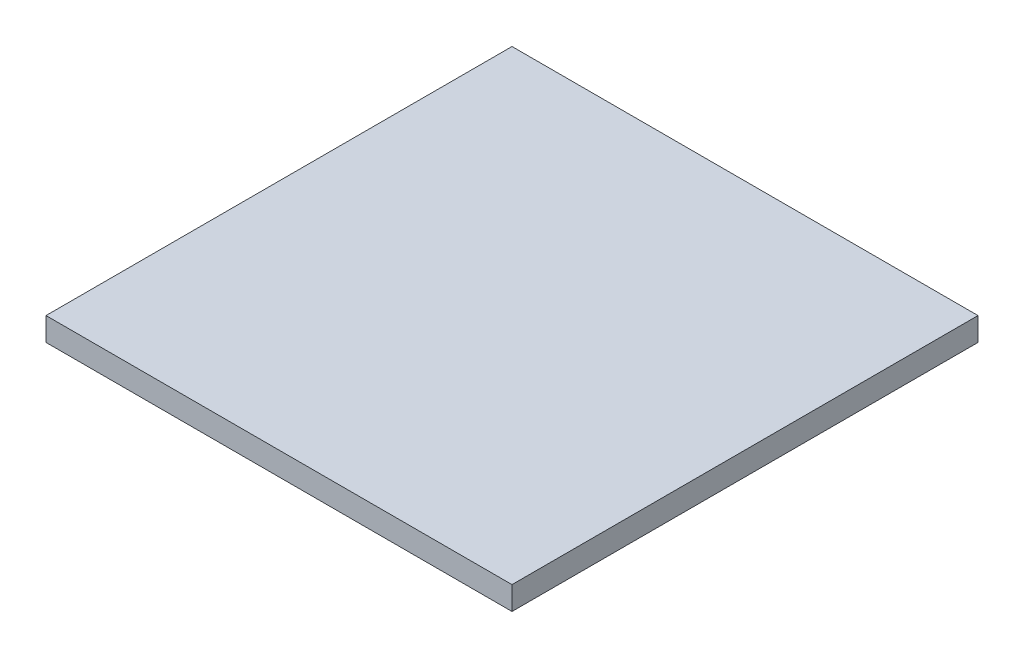
ISO-10303-21;
HEADER;
FILE_DESCRIPTION(('STEP AP214'),'2;1');
FILE_NAME('part.step','',(''),(''),'','','');
FILE_SCHEMA(('AUTOMOTIVE_DESIGN { 1 0 10303 214 1 1 1 1 }'));
ENDSEC;
DATA;
#1=APPLICATION_CONTEXT('core data for automotive mechanical design processes');
#2=APPLICATION_PROTOCOL_DEFINITION('international standard','automotive_design',2000,#1);
#3=PRODUCT_CONTEXT('',#1,'mechanical');
#4=PRODUCT('Part','Part','',(#3));
#5=PRODUCT_RELATED_PRODUCT_CATEGORY('part','',(#4));
#6=PRODUCT_DEFINITION_FORMATION('','',#4);
#7=PRODUCT_DEFINITION_CONTEXT('part definition',#1,'design');
#8=PRODUCT_DEFINITION('design','',#6,#7);
#9=PRODUCT_DEFINITION_SHAPE('','',#8);
#10=(LENGTH_UNIT() NAMED_UNIT(*) SI_UNIT(.MILLI.,.METRE.));
#11=(NAMED_UNIT(*) PLANE_ANGLE_UNIT() SI_UNIT($,.RADIAN.));
#12=(NAMED_UNIT(*) SI_UNIT($,.STERADIAN.) SOLID_ANGLE_UNIT());
#13=UNCERTAINTY_MEASURE_WITH_UNIT(LENGTH_MEASURE(1.E-05),#10,'distance_accuracy_value','');
#14=(GEOMETRIC_REPRESENTATION_CONTEXT(3) GLOBAL_UNCERTAINTY_ASSIGNED_CONTEXT((#13)) GLOBAL_UNIT_ASSIGNED_CONTEXT((#10,
#11,#12)) REPRESENTATION_CONTEXT('',''));
#15=CARTESIAN_POINT('',(0.,0.,0.));
#16=DIRECTION('',(0.,0.,1.));
#17=DIRECTION('',(1.,0.,0.));
#18=AXIS2_PLACEMENT_3D('',#15,#16,#17);
#19=CARTESIAN_POINT('',(-18.6294069092498,1.,-11.9401926953754));
#20=DIRECTION('',(1.,0.,0.));
#21=DIRECTION('',(0.,0.,-1.));
#22=AXIS2_PLACEMENT_3D('',#19,#20,#21);
#23=PLANE('',#22);
#24=DIRECTION('',(0.,0.,1.));
#25=VECTOR('',#24,1.);
#26=CARTESIAN_POINT('',(-18.6294069092498,0.,-11.9401926953754));
#27=LINE('',#26,#25);
#28=CARTESIAN_POINT('',(-18.6294069092498,0.,-11.9401926953754));
#29=VERTEX_POINT('',#28);
#30=CARTESIAN_POINT('',(-18.6294069092498,0.,8.0598073046246));
#31=VERTEX_POINT('',#30);
#32=EDGE_CURVE('E95',#29,#31,#27,.T.);
#33=ORIENTED_EDGE('',*,*,#32,.T.);
#34=DIRECTION('',(0.,-1.,0.));
#35=VECTOR('',#34,1.);
#36=CARTESIAN_POINT('',(-18.6294069092498,1.,8.0598073046246));
#37=LINE('',#36,#35);
#38=CARTESIAN_POINT('',(-18.6294069092498,1.,8.0598073046246));
#39=VERTEX_POINT('',#38);
#40=EDGE_CURVE('E11',#39,#31,#37,.T.);
#41=ORIENTED_EDGE('',*,*,#40,.F.);
#42=DIRECTION('',(0.,0.,1.));
#43=VECTOR('',#42,1.);
#44=CARTESIAN_POINT('',(-18.6294069092498,1.,-11.9401926953754));
#45=LINE('',#44,#43);
#46=CARTESIAN_POINT('',(-18.6294069092498,1.,-11.9401926953754));
#47=VERTEX_POINT('',#46);
#48=EDGE_CURVE('E83',#47,#39,#45,.T.);
#49=ORIENTED_EDGE('',*,*,#48,.F.);
#50=DIRECTION('',(0.,-1.,0.));
#51=VECTOR('',#50,1.);
#52=CARTESIAN_POINT('',(-18.6294069092498,1.,-11.9401926953754));
#53=LINE('',#52,#51);
#54=EDGE_CURVE('E91',#47,#29,#53,.T.);
#55=ORIENTED_EDGE('',*,*,#54,.T.);
#56=EDGE_LOOP('',(#33,#41,#49,#55));
#57=FACE_BOUND('',#56,.T.);
#58=ADVANCED_FACE('F32',(#57),#23,.F.);
#59=CARTESIAN_POINT('',(-18.6294069092498,1.,8.0598073046246));
#60=DIRECTION('',(0.,0.,-1.));
#61=DIRECTION('',(-1.,0.,0.));
#62=AXIS2_PLACEMENT_3D('',#59,#60,#61);
#63=PLANE('',#62);
#64=DIRECTION('',(1.,0.,0.));
#65=VECTOR('',#64,1.);
#66=CARTESIAN_POINT('',(-18.6294069092498,0.,8.0598073046246));
#67=LINE('',#66,#65);
#68=CARTESIAN_POINT('',(1.37059309075019,0.,8.0598073046246));
#69=VERTEX_POINT('',#68);
#70=EDGE_CURVE('E87',#31,#69,#67,.T.);
#71=ORIENTED_EDGE('',*,*,#70,.T.);
#72=DIRECTION('',(0.,-1.,0.));
#73=VECTOR('',#72,1.);
#74=CARTESIAN_POINT('',(1.37059309075019,1.,8.0598073046246));
#75=LINE('',#74,#73);
#76=CARTESIAN_POINT('',(1.37059309075019,1.,8.0598073046246));
#77=VERTEX_POINT('',#76);
#78=EDGE_CURVE('E40',#77,#69,#75,.T.);
#79=ORIENTED_EDGE('',*,*,#78,.F.);
#80=DIRECTION('',(1.,0.,0.));
#81=VECTOR('',#80,1.);
#82=CARTESIAN_POINT('',(-18.6294069092498,1.,8.0598073046246));
#83=LINE('',#82,#81);
#84=EDGE_CURVE('E78',#39,#77,#83,.T.);
#85=ORIENTED_EDGE('',*,*,#84,.F.);
#86=ORIENTED_EDGE('',*,*,#40,.T.);
#87=EDGE_LOOP('',(#71,#79,#85,#86));
#88=FACE_BOUND('',#87,.T.);
#89=ADVANCED_FACE('F86',(#88),#63,.F.);
#90=CARTESIAN_POINT('',(1.37059309075019,1.,-11.9401926953754));
#91=DIRECTION('',(-1.,0.,0.));
#92=DIRECTION('',(0.,0.,1.));
#93=AXIS2_PLACEMENT_3D('',#90,#91,#92);
#94=PLANE('',#93);
#95=DIRECTION('',(0.,0.,-1.));
#96=VECTOR('',#95,1.);
#97=CARTESIAN_POINT('',(1.37059309075019,0.,-11.9401926953754));
#98=LINE('',#97,#96);
#99=CARTESIAN_POINT('',(1.37059309075019,0.,-11.9401926953754));
#100=VERTEX_POINT('',#99);
#101=EDGE_CURVE('E65',#69,#100,#98,.T.);
#102=ORIENTED_EDGE('',*,*,#101,.T.);
#103=DIRECTION('',(0.,-1.,0.));
#104=VECTOR('',#103,1.);
#105=CARTESIAN_POINT('',(1.37059309075019,1.,-11.9401926953754));
#106=LINE('',#105,#104);
#107=CARTESIAN_POINT('',(1.37059309075019,1.,-11.9401926953754));
#108=VERTEX_POINT('',#107);
#109=EDGE_CURVE('E88',#108,#100,#106,.T.);
#110=ORIENTED_EDGE('',*,*,#109,.F.);
#111=DIRECTION('',(0.,0.,-1.));
#112=VECTOR('',#111,1.);
#113=CARTESIAN_POINT('',(1.37059309075019,1.,-11.9401926953754));
#114=LINE('',#113,#112);
#115=EDGE_CURVE('E81',#77,#108,#114,.T.);
#116=ORIENTED_EDGE('',*,*,#115,.F.);
#117=ORIENTED_EDGE('',*,*,#78,.T.);
#118=EDGE_LOOP('',(#102,#110,#116,#117));
#119=FACE_BOUND('',#118,.T.);
#120=ADVANCED_FACE('F89',(#119),#94,.F.);
#121=CARTESIAN_POINT('',(-18.6294069092498,1.,-11.9401926953754));
#122=DIRECTION('',(0.,0.,1.));
#123=DIRECTION('',(1.,0.,0.));
#124=AXIS2_PLACEMENT_3D('',#121,#122,#123);
#125=PLANE('',#124);
#126=DIRECTION('',(-1.,0.,0.));
#127=VECTOR('',#126,1.);
#128=CARTESIAN_POINT('',(-18.6294069092498,0.,-11.9401926953754));
#129=LINE('',#128,#127);
#130=EDGE_CURVE('E71',#100,#29,#129,.T.);
#131=ORIENTED_EDGE('',*,*,#130,.T.);
#132=ORIENTED_EDGE('',*,*,#54,.F.);
#133=DIRECTION('',(-1.,0.,0.));
#134=VECTOR('',#133,1.);
#135=CARTESIAN_POINT('',(-18.6294069092498,1.,-11.9401926953754));
#136=LINE('',#135,#134);
#137=EDGE_CURVE('E48',#108,#47,#136,.T.);
#138=ORIENTED_EDGE('',*,*,#137,.F.);
#139=ORIENTED_EDGE('',*,*,#109,.T.);
#140=EDGE_LOOP('',(#131,#132,#138,#139));
#141=FACE_BOUND('',#140,.T.);
#142=ADVANCED_FACE('F102',(#141),#125,.F.);
#143=CARTESIAN_POINT('',(0.,1.,0.));
#144=DIRECTION('',(0.,1.,0.));
#145=DIRECTION('',(0.,0.,1.));
#146=AXIS2_PLACEMENT_3D('',#143,#144,#145);
#147=PLANE('',#146);
#148=ORIENTED_EDGE('',*,*,#48,.T.);
#149=ORIENTED_EDGE('',*,*,#84,.T.);
#150=ORIENTED_EDGE('',*,*,#115,.T.);
#151=ORIENTED_EDGE('',*,*,#137,.T.);
#152=EDGE_LOOP('',(#148,#149,#150,#151));
#153=FACE_BOUND('',#152,.T.);
#154=ADVANCED_FACE('F79',(#153),#147,.T.);
#155=CARTESIAN_POINT('',(0.,0.,0.));
#156=DIRECTION('',(0.,1.,0.));
#157=DIRECTION('',(0.,0.,1.));
#158=AXIS2_PLACEMENT_3D('',#155,#156,#157);
#159=PLANE('',#158);
#160=ORIENTED_EDGE('',*,*,#32,.F.);
#161=ORIENTED_EDGE('',*,*,#130,.F.);
#162=ORIENTED_EDGE('',*,*,#101,.F.);
#163=ORIENTED_EDGE('',*,*,#70,.F.);
#164=EDGE_LOOP('',(#160,#161,#162,#163));
#165=FACE_BOUND('',#164,.T.);
#166=ADVANCED_FACE('F105',(#165),#159,.F.);
#167=CLOSED_SHELL('',(#58,#89,#120,#142,#154,#166));
#168=MANIFOLD_SOLID_BREP('B2',#167);
#169=ADVANCED_BREP_SHAPE_REPRESENTATION('',(#18,#168),#14);
#170=SHAPE_DEFINITION_REPRESENTATION(#9,#169);
ENDSEC;
END-ISO-10303-21;
